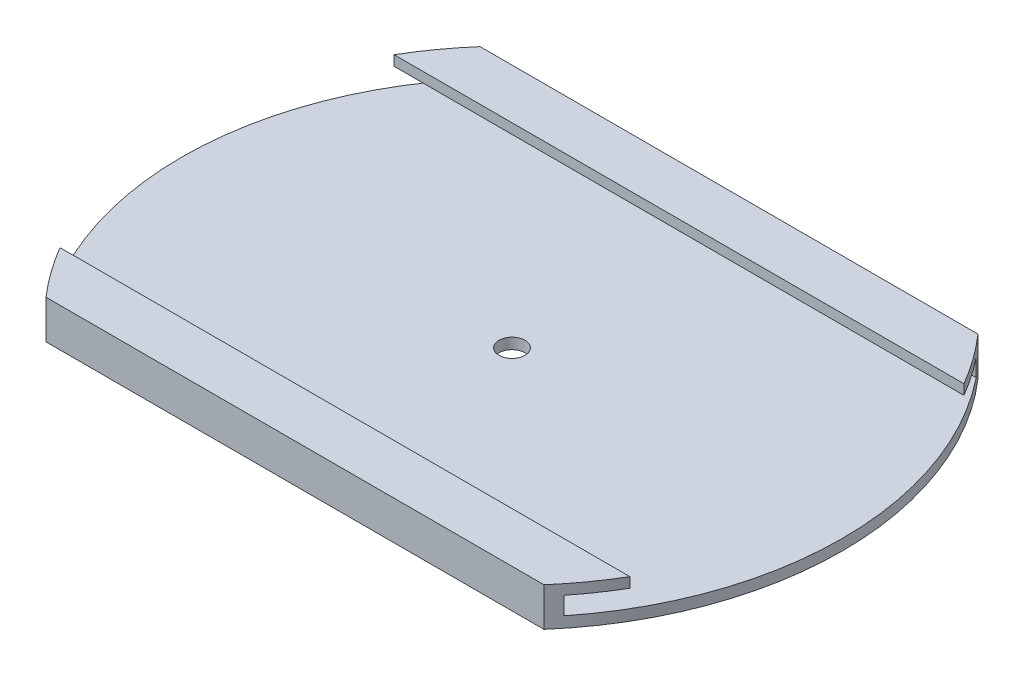
ISO-10303-21;
HEADER;
FILE_DESCRIPTION(('STEP AP214'),'2;1');
FILE_NAME('part.step','',(''),(''),'','','');
FILE_SCHEMA(('AUTOMOTIVE_DESIGN { 1 0 10303 214 1 1 1 1 }'));
ENDSEC;
DATA;
#1=APPLICATION_CONTEXT('core data for automotive mechanical design processes');
#2=APPLICATION_PROTOCOL_DEFINITION('international standard','automotive_design',2000,#1);
#3=PRODUCT_CONTEXT('',#1,'mechanical');
#4=PRODUCT('Part','Part','',(#3));
#5=PRODUCT_RELATED_PRODUCT_CATEGORY('part','',(#4));
#6=PRODUCT_DEFINITION_FORMATION('','',#4);
#7=PRODUCT_DEFINITION_CONTEXT('part definition',#1,'design');
#8=PRODUCT_DEFINITION('design','',#6,#7);
#9=PRODUCT_DEFINITION_SHAPE('','',#8);
#10=(LENGTH_UNIT() NAMED_UNIT(*) SI_UNIT(.MILLI.,.METRE.));
#11=(NAMED_UNIT(*) PLANE_ANGLE_UNIT() SI_UNIT($,.RADIAN.));
#12=(NAMED_UNIT(*) SI_UNIT($,.STERADIAN.) SOLID_ANGLE_UNIT());
#13=UNCERTAINTY_MEASURE_WITH_UNIT(LENGTH_MEASURE(1.E-05),#10,'distance_accuracy_value','');
#14=(GEOMETRIC_REPRESENTATION_CONTEXT(3) GLOBAL_UNCERTAINTY_ASSIGNED_CONTEXT((#13)) GLOBAL_UNIT_ASSIGNED_CONTEXT((#10,
#11,#12)) REPRESENTATION_CONTEXT('',''));
#15=CARTESIAN_POINT('',(0.,0.,0.));
#16=DIRECTION('',(0.,0.,1.));
#17=DIRECTION('',(1.,0.,0.));
#18=AXIS2_PLACEMENT_3D('',#15,#16,#17);
#19=CARTESIAN_POINT('',(0.,8.9,0.));
#20=DIRECTION('',(0.,-1.,0.));
#21=DIRECTION('',(0.,0.,-1.));
#22=AXIS2_PLACEMENT_3D('',#19,#20,#21);
#23=PLANE('',#22);
#24=CARTESIAN_POINT('',(0.,8.9,0.));
#25=DIRECTION('',(0.,1.,0.));
#26=DIRECTION('',(0.,0.,-1.));
#27=AXIS2_PLACEMENT_3D('',#24,#25,#26);
#28=CIRCLE('',#27,76.0150807406004);
#29=CARTESIAN_POINT('',(57.3,8.9,49.95));
#30=VERTEX_POINT('',#29);
#31=CARTESIAN_POINT('',(65.5735464955191,8.9,38.45));
#32=VERTEX_POINT('',#31);
#33=EDGE_CURVE('E227',#30,#32,#28,.T.);
#34=ORIENTED_EDGE('',*,*,#33,.T.);
#35=DIRECTION('',(1.,0.,0.));
#36=VECTOR('',#35,1.);
#37=CARTESIAN_POINT('',(-76.0150807406004,8.9,38.45));
#38=LINE('',#37,#36);
#39=CARTESIAN_POINT('',(-65.5735464955191,8.9,38.45));
#40=VERTEX_POINT('',#39);
#41=EDGE_CURVE('E137',#40,#32,#38,.T.);
#42=ORIENTED_EDGE('',*,*,#41,.F.);
#43=CARTESIAN_POINT('',(0.,8.9,0.));
#44=DIRECTION('',(0.,1.,0.));
#45=DIRECTION('',(0.,0.,1.));
#46=AXIS2_PLACEMENT_3D('',#43,#44,#45);
#47=CIRCLE('',#46,76.0150807406004);
#48=CARTESIAN_POINT('',(-57.3,8.9,49.95));
#49=VERTEX_POINT('',#48);
#50=EDGE_CURVE('E154',#40,#49,#47,.T.);
#51=ORIENTED_EDGE('',*,*,#50,.T.);
#52=DIRECTION('',(1.,0.,0.));
#53=VECTOR('',#52,1.);
#54=CARTESIAN_POINT('',(-57.3,8.9,49.95));
#55=LINE('',#54,#53);
#56=EDGE_CURVE('E153',#49,#30,#55,.T.);
#57=ORIENTED_EDGE('',*,*,#56,.T.);
#58=EDGE_LOOP('',(#34,#42,#51,#57));
#59=FACE_BOUND('',#58,.T.);
#60=ADVANCED_FACE('F43',(#59),#23,.F.);
#61=CARTESIAN_POINT('',(-76.0150807406004,6.5801244353372,47.45));
#62=DIRECTION('',(0.,1.,0.));
#63=DIRECTION('',(0.,0.,1.));
#64=AXIS2_PLACEMENT_3D('',#61,#62,#63);
#65=PLANE('',#64);
#66=CARTESIAN_POINT('',(0.,6.5801244353372,0.));
#67=DIRECTION('',(0.,1.,0.));
#68=DIRECTION('',(0.,0.,1.));
#69=AXIS2_PLACEMENT_3D('',#66,#67,#68);
#70=CIRCLE('',#69,76.0150807406004);
#71=CARTESIAN_POINT('',(-65.5735464955191,6.5801244353372,38.45));
#72=VERTEX_POINT('',#71);
#73=CARTESIAN_POINT('',(-59.3867830413468,6.5801244353372,47.45));
#74=VERTEX_POINT('',#73);
#75=EDGE_CURVE('E187',#72,#74,#70,.T.);
#76=ORIENTED_EDGE('',*,*,#75,.F.);
#77=DIRECTION('',(1.,0.,0.));
#78=VECTOR('',#77,1.);
#79=CARTESIAN_POINT('',(-76.0150807406004,6.5801244353372,38.45));
#80=LINE('',#79,#78);
#81=CARTESIAN_POINT('',(65.5735464955191,6.5801244353372,38.45));
#82=VERTEX_POINT('',#81);
#83=EDGE_CURVE('E11',#72,#82,#80,.T.);
#84=ORIENTED_EDGE('',*,*,#83,.T.);
#85=CARTESIAN_POINT('',(0.,6.5801244353372,0.));
#86=DIRECTION('',(0.,1.,0.));
#87=DIRECTION('',(0.,0.,1.));
#88=AXIS2_PLACEMENT_3D('',#85,#86,#87);
#89=CIRCLE('',#88,76.0150807406004);
#90=CARTESIAN_POINT('',(59.3867830413468,6.5801244353372,47.45));
#91=VERTEX_POINT('',#90);
#92=EDGE_CURVE('E224',#91,#82,#89,.T.);
#93=ORIENTED_EDGE('',*,*,#92,.F.);
#94=DIRECTION('',(1.,0.,0.));
#95=VECTOR('',#94,1.);
#96=CARTESIAN_POINT('',(-76.0150807406004,6.5801244353372,47.45));
#97=LINE('',#96,#95);
#98=EDGE_CURVE('E210',#74,#91,#97,.T.);
#99=ORIENTED_EDGE('',*,*,#98,.F.);
#100=EDGE_LOOP('',(#76,#84,#93,#99));
#101=FACE_BOUND('',#100,.T.);
#102=ADVANCED_FACE('F248',(#101),#65,.F.);
#103=CARTESIAN_POINT('',(0.,8.9,0.));
#104=DIRECTION('',(0.,-1.,0.));
#105=DIRECTION('',(0.,0.,-1.));
#106=AXIS2_PLACEMENT_3D('',#103,#104,#105);
#107=CYLINDRICAL_SURFACE('',#106,76.0150807406004);
#108=ORIENTED_EDGE('',*,*,#92,.T.);
#109=DIRECTION('',(0.,-1.,0.));
#110=VECTOR('',#109,1.);
#111=CARTESIAN_POINT('',(65.5735464955191,8.9,38.45));
#112=LINE('',#111,#110);
#113=EDGE_CURVE('E59',#82,#32,#112,.F.);
#114=ORIENTED_EDGE('',*,*,#113,.T.);
#115=ORIENTED_EDGE('',*,*,#33,.F.);
#116=DIRECTION('',(0.,-1.,0.));
#117=VECTOR('',#116,1.);
#118=CARTESIAN_POINT('',(57.3,8.9,49.95));
#119=LINE('',#118,#117);
#120=CARTESIAN_POINT('',(57.3,0.,49.95));
#121=VERTEX_POINT('',#120);
#122=EDGE_CURVE('E156',#30,#121,#119,.T.);
#123=ORIENTED_EDGE('',*,*,#122,.T.);
#124=CARTESIAN_POINT('',(0.,0.,0.));
#125=DIRECTION('',(0.,1.,0.));
#126=DIRECTION('',(0.,0.,-1.));
#127=AXIS2_PLACEMENT_3D('',#124,#125,#126);
#128=CIRCLE('',#127,76.0150807406004);
#129=CARTESIAN_POINT('',(57.3,0.,-49.95));
#130=VERTEX_POINT('',#129);
#131=EDGE_CURVE('E161',#121,#130,#128,.T.);
#132=ORIENTED_EDGE('',*,*,#131,.T.);
#133=DIRECTION('',(0.,-1.,0.));
#134=VECTOR('',#133,1.);
#135=CARTESIAN_POINT('',(57.3,8.9,-49.95));
#136=LINE('',#135,#134);
#137=CARTESIAN_POINT('',(57.3,8.9,-49.95));
#138=VERTEX_POINT('',#137);
#139=EDGE_CURVE('E179',#138,#130,#136,.T.);
#140=ORIENTED_EDGE('',*,*,#139,.F.);
#141=CARTESIAN_POINT('',(65.5735464955191,8.9,-38.45));
#142=VERTEX_POINT('',#141);
#143=EDGE_CURVE('E171',#142,#138,#28,.T.);
#144=ORIENTED_EDGE('',*,*,#143,.F.);
#145=DIRECTION('',(0.,-1.,0.));
#146=VECTOR('',#145,1.);
#147=CARTESIAN_POINT('',(65.5735464955191,8.9,-38.45));
#148=LINE('',#147,#146);
#149=CARTESIAN_POINT('',(65.5735464955191,6.5801244353372,-38.45));
#150=VERTEX_POINT('',#149);
#151=EDGE_CURVE('E133',#142,#150,#148,.T.);
#152=ORIENTED_EDGE('',*,*,#151,.T.);
#153=CARTESIAN_POINT('',(59.3867830413468,6.5801244353372,-47.45));
#154=VERTEX_POINT('',#153);
#155=EDGE_CURVE('E197',#150,#154,#89,.T.);
#156=ORIENTED_EDGE('',*,*,#155,.T.);
#157=DIRECTION('',(0.,-1.,0.));
#158=VECTOR('',#157,1.);
#159=CARTESIAN_POINT('',(59.3867830413468,8.9,-47.45));
#160=LINE('',#159,#158);
#161=CARTESIAN_POINT('',(59.3867830413468,2.5,-47.45));
#162=VERTEX_POINT('',#161);
#163=EDGE_CURVE('E222',#154,#162,#160,.T.);
#164=ORIENTED_EDGE('',*,*,#163,.T.);
#165=CARTESIAN_POINT('',(0.,2.5,0.));
#166=DIRECTION('',(0.,-1.,0.));
#167=DIRECTION('',(0.,0.,-1.));
#168=AXIS2_PLACEMENT_3D('',#165,#166,#167);
#169=CIRCLE('',#168,76.0150807406004);
#170=CARTESIAN_POINT('',(59.3867830413468,2.5,47.45));
#171=VERTEX_POINT('',#170);
#172=EDGE_CURVE('E213',#162,#171,#169,.T.);
#173=ORIENTED_EDGE('',*,*,#172,.T.);
#174=DIRECTION('',(0.,-1.,0.));
#175=VECTOR('',#174,1.);
#176=CARTESIAN_POINT('',(59.3867830413468,8.9,47.45));
#177=LINE('',#176,#175);
#178=EDGE_CURVE('E165',#171,#91,#177,.F.);
#179=ORIENTED_EDGE('',*,*,#178,.T.);
#180=EDGE_LOOP('',(#108,#114,#115,#123,#132,#140,#144,#152,#156,#164,#173,#179));
#181=FACE_BOUND('',#180,.T.);
#182=ADVANCED_FACE('F45',(#181),#107,.T.);
#183=CARTESIAN_POINT('',(-57.3,8.9,-49.95));
#184=DIRECTION('',(0.,0.,1.));
#185=DIRECTION('',(1.,0.,0.));
#186=AXIS2_PLACEMENT_3D('',#183,#184,#185);
#187=PLANE('',#186);
#188=DIRECTION('',(-1.,0.,0.));
#189=VECTOR('',#188,1.);
#190=CARTESIAN_POINT('',(-57.3,0.,-49.95));
#191=LINE('',#190,#189);
#192=CARTESIAN_POINT('',(-57.3,0.,-49.95));
#193=VERTEX_POINT('',#192);
#194=EDGE_CURVE('E164',#130,#193,#191,.T.);
#195=ORIENTED_EDGE('',*,*,#194,.T.);
#196=DIRECTION('',(0.,-1.,0.));
#197=VECTOR('',#196,1.);
#198=CARTESIAN_POINT('',(-57.3,8.9,-49.95));
#199=LINE('',#198,#197);
#200=CARTESIAN_POINT('',(-57.3,8.9,-49.95));
#201=VERTEX_POINT('',#200);
#202=EDGE_CURVE('E177',#201,#193,#199,.T.);
#203=ORIENTED_EDGE('',*,*,#202,.F.);
#204=DIRECTION('',(-1.,0.,0.));
#205=VECTOR('',#204,1.);
#206=CARTESIAN_POINT('',(-57.3,8.9,-49.95));
#207=LINE('',#206,#205);
#208=EDGE_CURVE('E151',#138,#201,#207,.T.);
#209=ORIENTED_EDGE('',*,*,#208,.F.);
#210=ORIENTED_EDGE('',*,*,#139,.T.);
#211=EDGE_LOOP('',(#195,#203,#209,#210));
#212=FACE_BOUND('',#211,.T.);
#213=ADVANCED_FACE('F233',(#212),#187,.F.);
#214=CARTESIAN_POINT('',(0.,8.9,0.));
#215=DIRECTION('',(0.,-1.,0.));
#216=DIRECTION('',(0.,0.,-1.));
#217=AXIS2_PLACEMENT_3D('',#214,#215,#216);
#218=CYLINDRICAL_SURFACE('',#217,76.0150807406004);
#219=ORIENTED_EDGE('',*,*,#50,.F.);
#220=DIRECTION('',(0.,-1.,0.));
#221=VECTOR('',#220,1.);
#222=CARTESIAN_POINT('',(-65.5735464955191,8.9,38.45));
#223=LINE('',#222,#221);
#224=EDGE_CURVE('E203',#40,#72,#223,.T.);
#225=ORIENTED_EDGE('',*,*,#224,.T.);
#226=ORIENTED_EDGE('',*,*,#75,.T.);
#227=DIRECTION('',(0.,-1.,0.));
#228=VECTOR('',#227,1.);
#229=CARTESIAN_POINT('',(-59.3867830413468,8.9,47.45));
#230=LINE('',#229,#228);
#231=CARTESIAN_POINT('',(-59.3867830413468,2.5,47.45));
#232=VERTEX_POINT('',#231);
#233=EDGE_CURVE('E189',#74,#232,#230,.T.);
#234=ORIENTED_EDGE('',*,*,#233,.T.);
#235=CARTESIAN_POINT('',(0.,2.5,0.));
#236=DIRECTION('',(0.,-1.,0.));
#237=DIRECTION('',(0.,0.,-1.));
#238=AXIS2_PLACEMENT_3D('',#235,#236,#237);
#239=CIRCLE('',#238,76.0150807406004);
#240=CARTESIAN_POINT('',(-59.3867830413468,2.5,-47.45));
#241=VERTEX_POINT('',#240);
#242=EDGE_CURVE('E182',#232,#241,#239,.T.);
#243=ORIENTED_EDGE('',*,*,#242,.T.);
#244=DIRECTION('',(0.,-1.,0.));
#245=VECTOR('',#244,1.);
#246=CARTESIAN_POINT('',(-59.3867830413468,8.9,-47.45));
#247=LINE('',#246,#245);
#248=CARTESIAN_POINT('',(-59.3867830413468,6.5801244353372,-47.45));
#249=VERTEX_POINT('',#248);
#250=EDGE_CURVE('E185',#241,#249,#247,.F.);
#251=ORIENTED_EDGE('',*,*,#250,.T.);
#252=CARTESIAN_POINT('',(-65.5735464955191,6.5801244353372,-38.45));
#253=VERTEX_POINT('',#252);
#254=EDGE_CURVE('E147',#249,#253,#70,.T.);
#255=ORIENTED_EDGE('',*,*,#254,.T.);
#256=DIRECTION('',(0.,-1.,0.));
#257=VECTOR('',#256,1.);
#258=CARTESIAN_POINT('',(-65.5735464955191,8.9,-38.45));
#259=LINE('',#258,#257);
#260=CARTESIAN_POINT('',(-65.5735464955191,8.9,-38.45));
#261=VERTEX_POINT('',#260);
#262=EDGE_CURVE('E66',#253,#261,#259,.F.);
#263=ORIENTED_EDGE('',*,*,#262,.T.);
#264=EDGE_CURVE('E145',#201,#261,#47,.T.);
#265=ORIENTED_EDGE('',*,*,#264,.F.);
#266=ORIENTED_EDGE('',*,*,#202,.T.);
#267=CARTESIAN_POINT('',(0.,0.,0.));
#268=DIRECTION('',(0.,1.,0.));
#269=DIRECTION('',(0.,0.,1.));
#270=AXIS2_PLACEMENT_3D('',#267,#268,#269);
#271=CIRCLE('',#270,76.0150807406004);
#272=CARTESIAN_POINT('',(-57.3,0.,49.95));
#273=VERTEX_POINT('',#272);
#274=EDGE_CURVE('E167',#193,#273,#271,.T.);
#275=ORIENTED_EDGE('',*,*,#274,.T.);
#276=DIRECTION('',(0.,-1.,0.));
#277=VECTOR('',#276,1.);
#278=CARTESIAN_POINT('',(-57.3,8.9,49.95));
#279=LINE('',#278,#277);
#280=EDGE_CURVE('E174',#49,#273,#279,.T.);
#281=ORIENTED_EDGE('',*,*,#280,.F.);
#282=EDGE_LOOP('',(#219,#225,#226,#234,#243,#251,#255,#263,#265,#266,#275,#281));
#283=FACE_BOUND('',#282,.T.);
#284=ADVANCED_FACE('F143',(#283),#218,.T.);
#285=CARTESIAN_POINT('',(-57.3,8.9,49.95));
#286=DIRECTION('',(0.,0.,-1.));
#287=DIRECTION('',(-1.,0.,0.));
#288=AXIS2_PLACEMENT_3D('',#285,#286,#287);
#289=PLANE('',#288);
#290=DIRECTION('',(1.,0.,0.));
#291=VECTOR('',#290,1.);
#292=CARTESIAN_POINT('',(-57.3,0.,49.95));
#293=LINE('',#292,#291);
#294=EDGE_CURVE('E169',#273,#121,#293,.T.);
#295=ORIENTED_EDGE('',*,*,#294,.T.);
#296=ORIENTED_EDGE('',*,*,#122,.F.);
#297=ORIENTED_EDGE('',*,*,#56,.F.);
#298=ORIENTED_EDGE('',*,*,#280,.T.);
#299=EDGE_LOOP('',(#295,#296,#297,#298));
#300=FACE_BOUND('',#299,.T.);
#301=ADVANCED_FACE('F243',(#300),#289,.F.);
#302=ORIENTED_EDGE('',*,*,#264,.T.);
#303=DIRECTION('',(1.,0.,0.));
#304=VECTOR('',#303,1.);
#305=CARTESIAN_POINT('',(-76.0150807406004,8.9,-38.45));
#306=LINE('',#305,#304);
#307=EDGE_CURVE('E130',#261,#142,#306,.T.);
#308=ORIENTED_EDGE('',*,*,#307,.T.);
#309=ORIENTED_EDGE('',*,*,#143,.T.);
#310=ORIENTED_EDGE('',*,*,#208,.T.);
#311=EDGE_LOOP('',(#302,#308,#309,#310));
#312=FACE_BOUND('',#311,.T.);
#313=ADVANCED_FACE('F149',(#312),#23,.F.);
#314=CARTESIAN_POINT('',(0.,0.,0.));
#315=DIRECTION('',(0.,-1.,0.));
#316=DIRECTION('',(0.,0.,-1.));
#317=AXIS2_PLACEMENT_3D('',#314,#315,#316);
#318=PLANE('',#317);
#319=CARTESIAN_POINT('',(0.,0.,0.));
#320=DIRECTION('',(0.,1.,0.));
#321=DIRECTION('',(0.,0.,1.));
#322=AXIS2_PLACEMENT_3D('',#319,#320,#321);
#323=CIRCLE('',#322,3.);
#324=CARTESIAN_POINT('',(0.,0.,3.));
#325=VERTEX_POINT('',#324);
#326=EDGE_CURVE('E421',#325,#325,#323,.T.);
#327=ORIENTED_EDGE('',*,*,#326,.T.);
#328=EDGE_LOOP('',(#327));
#329=FACE_BOUND('',#328,.T.);
#330=ORIENTED_EDGE('',*,*,#131,.F.);
#331=ORIENTED_EDGE('',*,*,#294,.F.);
#332=ORIENTED_EDGE('',*,*,#274,.F.);
#333=ORIENTED_EDGE('',*,*,#194,.F.);
#334=EDGE_LOOP('',(#330,#331,#332,#333));
#335=FACE_BOUND('',#334,.T.);
#336=ADVANCED_FACE('F238',(#329,#335),#318,.T.);
#337=CARTESIAN_POINT('',(-76.0150807406004,6.5801244353372,47.45));
#338=DIRECTION('',(0.,0.,1.));
#339=DIRECTION('',(1.,0.,0.));
#340=AXIS2_PLACEMENT_3D('',#337,#338,#339);
#341=PLANE('',#340);
#342=DIRECTION('',(1.,0.,0.));
#343=VECTOR('',#342,1.);
#344=CARTESIAN_POINT('',(-76.0150807406004,2.5,47.45));
#345=LINE('',#344,#343);
#346=EDGE_CURVE('E209',#232,#171,#345,.T.);
#347=ORIENTED_EDGE('',*,*,#346,.F.);
#348=ORIENTED_EDGE('',*,*,#233,.F.);
#349=ORIENTED_EDGE('',*,*,#98,.T.);
#350=ORIENTED_EDGE('',*,*,#178,.F.);
#351=EDGE_LOOP('',(#347,#348,#349,#350));
#352=FACE_BOUND('',#351,.T.);
#353=ADVANCED_FACE('F252',(#352),#341,.F.);
#354=ORIENTED_EDGE('',*,*,#155,.F.);
#355=DIRECTION('',(-1.,0.,0.));
#356=VECTOR('',#355,1.);
#357=CARTESIAN_POINT('',(-76.0150807406004,6.5801244353372,-38.45));
#358=LINE('',#357,#356);
#359=EDGE_CURVE('E52',#150,#253,#358,.T.);
#360=ORIENTED_EDGE('',*,*,#359,.T.);
#361=ORIENTED_EDGE('',*,*,#254,.F.);
#362=DIRECTION('',(1.,0.,0.));
#363=VECTOR('',#362,1.);
#364=CARTESIAN_POINT('',(-76.0150807406004,6.5801244353372,-47.45));
#365=LINE('',#364,#363);
#366=EDGE_CURVE('E214',#249,#154,#365,.T.);
#367=ORIENTED_EDGE('',*,*,#366,.T.);
#368=EDGE_LOOP('',(#354,#360,#361,#367));
#369=FACE_BOUND('',#368,.T.);
#370=ADVANCED_FACE('F194',(#369),#65,.F.);
#371=CARTESIAN_POINT('',(-76.0150807406004,6.5801244353372,-47.45));
#372=DIRECTION('',(0.,0.,-1.));
#373=DIRECTION('',(-1.,0.,0.));
#374=AXIS2_PLACEMENT_3D('',#371,#372,#373);
#375=PLANE('',#374);
#376=ORIENTED_EDGE('',*,*,#366,.F.);
#377=ORIENTED_EDGE('',*,*,#250,.F.);
#378=DIRECTION('',(1.,0.,0.));
#379=VECTOR('',#378,1.);
#380=CARTESIAN_POINT('',(-76.0150807406004,2.5,-47.45));
#381=LINE('',#380,#379);
#382=EDGE_CURVE('E216',#241,#162,#381,.T.);
#383=ORIENTED_EDGE('',*,*,#382,.T.);
#384=ORIENTED_EDGE('',*,*,#163,.F.);
#385=EDGE_LOOP('',(#376,#377,#383,#384));
#386=FACE_BOUND('',#385,.T.);
#387=ADVANCED_FACE('F257',(#386),#375,.F.);
#388=CARTESIAN_POINT('',(-76.0150807406004,2.5,47.45));
#389=DIRECTION('',(0.,-1.,0.));
#390=DIRECTION('',(0.,0.,-1.));
#391=AXIS2_PLACEMENT_3D('',#388,#389,#390);
#392=PLANE('',#391);
#393=CARTESIAN_POINT('',(0.,2.5,0.));
#394=DIRECTION('',(0.,-1.,0.));
#395=DIRECTION('',(0.,0.,-1.));
#396=AXIS2_PLACEMENT_3D('',#393,#394,#395);
#397=CIRCLE('',#396,3.);
#398=CARTESIAN_POINT('',(0.,2.5,-3.));
#399=VERTEX_POINT('',#398);
#400=EDGE_CURVE('E47',#399,#399,#397,.T.);
#401=ORIENTED_EDGE('',*,*,#400,.T.);
#402=EDGE_LOOP('',(#401));
#403=FACE_BOUND('',#402,.T.);
#404=ORIENTED_EDGE('',*,*,#382,.F.);
#405=ORIENTED_EDGE('',*,*,#242,.F.);
#406=ORIENTED_EDGE('',*,*,#346,.T.);
#407=ORIENTED_EDGE('',*,*,#172,.F.);
#408=EDGE_LOOP('',(#404,#405,#406,#407));
#409=FACE_BOUND('',#408,.T.);
#410=ADVANCED_FACE('F254',(#403,#409),#392,.F.);
#411=CARTESIAN_POINT('',(-76.0150807406004,8.9,-38.45));
#412=DIRECTION('',(0.,0.,-1.));
#413=DIRECTION('',(-1.,0.,0.));
#414=AXIS2_PLACEMENT_3D('',#411,#412,#413);
#415=PLANE('',#414);
#416=ORIENTED_EDGE('',*,*,#307,.F.);
#417=ORIENTED_EDGE('',*,*,#262,.F.);
#418=ORIENTED_EDGE('',*,*,#359,.F.);
#419=ORIENTED_EDGE('',*,*,#151,.F.);
#420=EDGE_LOOP('',(#416,#417,#418,#419));
#421=FACE_BOUND('',#420,.T.);
#422=ADVANCED_FACE('F131',(#421),#415,.F.);
#423=CARTESIAN_POINT('',(-76.0150807406004,8.9,38.45));
#424=DIRECTION('',(0.,0.,1.));
#425=DIRECTION('',(1.,0.,0.));
#426=AXIS2_PLACEMENT_3D('',#423,#424,#425);
#427=PLANE('',#426);
#428=ORIENTED_EDGE('',*,*,#83,.F.);
#429=ORIENTED_EDGE('',*,*,#224,.F.);
#430=ORIENTED_EDGE('',*,*,#41,.T.);
#431=ORIENTED_EDGE('',*,*,#113,.F.);
#432=EDGE_LOOP('',(#428,#429,#430,#431));
#433=FACE_BOUND('',#432,.T.);
#434=ADVANCED_FACE('F372',(#433),#427,.F.);
#435=CARTESIAN_POINT('',(0.,0.,0.));
#436=DIRECTION('',(0.,1.,0.));
#437=DIRECTION('',(0.,0.,1.));
#438=AXIS2_PLACEMENT_3D('',#435,#436,#437);
#439=CYLINDRICAL_SURFACE('',#438,3.);
#440=ORIENTED_EDGE('',*,*,#326,.F.);
#441=EDGE_LOOP('',(#440));
#442=FACE_BOUND('',#441,.T.);
#443=ORIENTED_EDGE('',*,*,#400,.F.);
#444=EDGE_LOOP('',(#443));
#445=FACE_BOUND('',#444,.T.);
#446=ADVANCED_FACE('F382',(#442,#445),#439,.F.);
#447=CLOSED_SHELL('',(#60,#102,#182,#213,#284,#301,#313,#336,#353,#370,#387,#410,#422,#434,#446));
#448=MANIFOLD_SOLID_BREP('B2',#447);
#449=ADVANCED_BREP_SHAPE_REPRESENTATION('',(#18,#448),#14);
#450=SHAPE_DEFINITION_REPRESENTATION(#9,#449);
ENDSEC;
END-ISO-10303-21;
